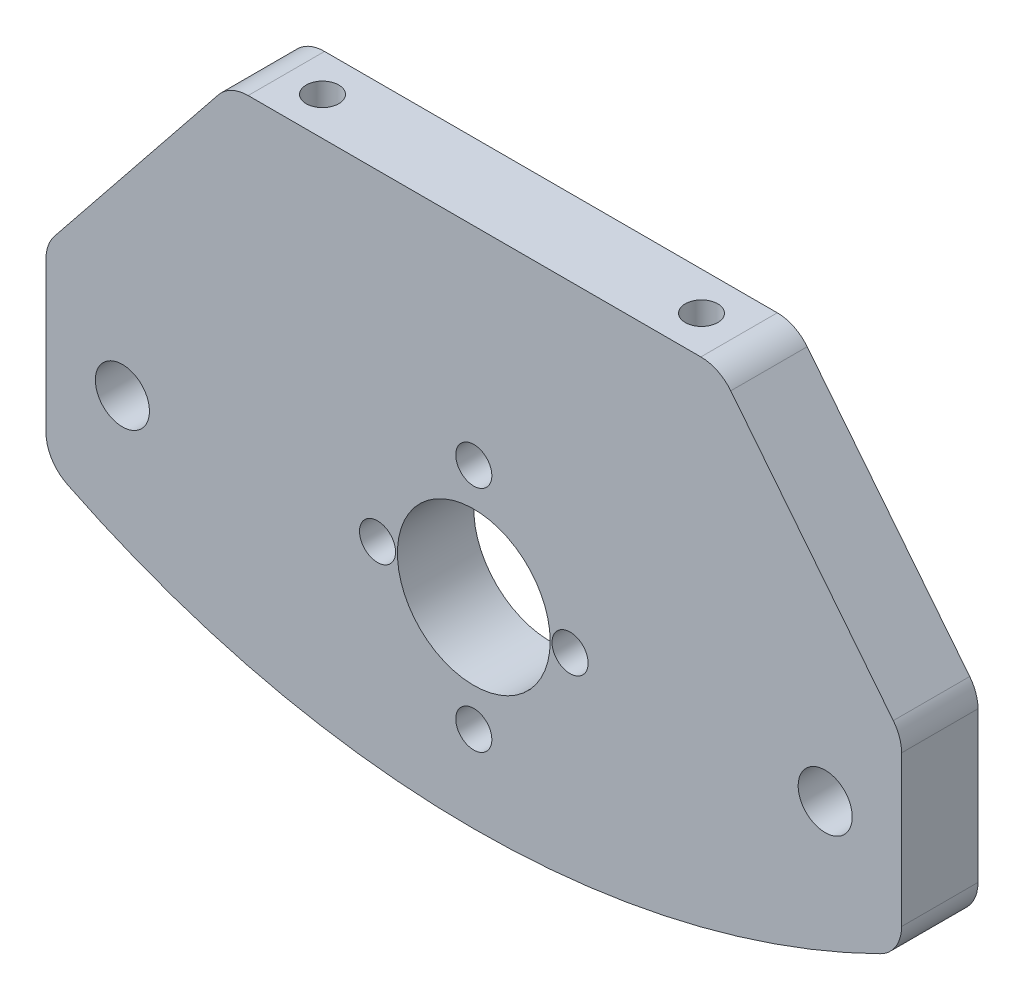
ISO-10303-21;
HEADER;
FILE_DESCRIPTION(('STEP AP214'),'2;1');
FILE_NAME('part.step','',(''),(''),'','','');
FILE_SCHEMA(('AUTOMOTIVE_DESIGN { 1 0 10303 214 1 1 1 1 }'));
ENDSEC;
DATA;
#1=APPLICATION_CONTEXT('core data for automotive mechanical design processes');
#2=APPLICATION_PROTOCOL_DEFINITION('international standard','automotive_design',2000,#1);
#3=PRODUCT_CONTEXT('',#1,'mechanical');
#4=PRODUCT('Part','Part','',(#3));
#5=PRODUCT_RELATED_PRODUCT_CATEGORY('part','',(#4));
#6=PRODUCT_DEFINITION_FORMATION('','',#4);
#7=PRODUCT_DEFINITION_CONTEXT('part definition',#1,'design');
#8=PRODUCT_DEFINITION('design','',#6,#7);
#9=PRODUCT_DEFINITION_SHAPE('','',#8);
#10=(LENGTH_UNIT() NAMED_UNIT(*) SI_UNIT(.MILLI.,.METRE.));
#11=(NAMED_UNIT(*) PLANE_ANGLE_UNIT() SI_UNIT($,.RADIAN.));
#12=(NAMED_UNIT(*) SI_UNIT($,.STERADIAN.) SOLID_ANGLE_UNIT());
#13=UNCERTAINTY_MEASURE_WITH_UNIT(LENGTH_MEASURE(1.E-05),#10,'distance_accuracy_value','');
#14=(GEOMETRIC_REPRESENTATION_CONTEXT(3) GLOBAL_UNCERTAINTY_ASSIGNED_CONTEXT((#13)) GLOBAL_UNIT_ASSIGNED_CONTEXT((#10,
#11,#12)) REPRESENTATION_CONTEXT('',''));
#15=CARTESIAN_POINT('',(0.,0.,0.));
#16=DIRECTION('',(0.,0.,1.));
#17=DIRECTION('',(1.,0.,0.));
#18=AXIS2_PLACEMENT_3D('',#15,#16,#17);
#19=CARTESIAN_POINT('',(0.,0.,6.35));
#20=DIRECTION('',(0.,0.,1.));
#21=DIRECTION('',(1.,0.,0.));
#22=AXIS2_PLACEMENT_3D('',#19,#20,#21);
#23=PLANE('',#22);
#24=CARTESIAN_POINT('',(29.2049999999999,-0.0909781516825678,6.35));
#25=DIRECTION('',(0.,0.,-1.));
#26=DIRECTION('',(-1.,0.,0.));
#27=AXIS2_PLACEMENT_3D('',#24,#25,#26);
#28=CIRCLE('',#27,2.2479);
#29=CARTESIAN_POINT('',(26.9570999999999,-0.0909781516825678,6.35));
#30=VERTEX_POINT('',#29);
#31=EDGE_CURVE('E165',#30,#30,#28,.T.);
#32=ORIENTED_EDGE('',*,*,#31,.T.);
#33=EDGE_LOOP('',(#32));
#34=FACE_BOUND('',#33,.T.);
#35=CARTESIAN_POINT('',(-29.2049999999999,-0.0909781516825678,6.35));
#36=DIRECTION('',(0.,0.,-1.));
#37=DIRECTION('',(-1.,0.,0.));
#38=AXIS2_PLACEMENT_3D('',#35,#36,#37);
#39=CIRCLE('',#38,2.2479);
#40=CARTESIAN_POINT('',(-31.4528999999999,-0.0909781516825678,6.35));
#41=VERTEX_POINT('',#40);
#42=EDGE_CURVE('E171',#41,#41,#39,.T.);
#43=ORIENTED_EDGE('',*,*,#42,.T.);
#44=EDGE_LOOP('',(#43));
#45=FACE_BOUND('',#44,.T.);
#46=CARTESIAN_POINT('',(8.,0.,6.35));
#47=DIRECTION('',(0.,0.,1.));
#48=DIRECTION('',(1.,0.,0.));
#49=AXIS2_PLACEMENT_3D('',#46,#47,#48);
#50=CIRCLE('',#49,1.5);
#51=CARTESIAN_POINT('',(9.5,0.,6.35));
#52=VERTEX_POINT('',#51);
#53=EDGE_CURVE('E181',#52,#52,#50,.T.);
#54=ORIENTED_EDGE('',*,*,#53,.F.);
#55=EDGE_LOOP('',(#54));
#56=FACE_BOUND('',#55,.T.);
#57=CARTESIAN_POINT('',(-8.,0.,6.35));
#58=DIRECTION('',(0.,0.,1.));
#59=DIRECTION('',(1.,0.,0.));
#60=AXIS2_PLACEMENT_3D('',#57,#58,#59);
#61=CIRCLE('',#60,1.5);
#62=CARTESIAN_POINT('',(-6.5,0.,6.35));
#63=VERTEX_POINT('',#62);
#64=EDGE_CURVE('E193',#63,#63,#61,.T.);
#65=ORIENTED_EDGE('',*,*,#64,.F.);
#66=EDGE_LOOP('',(#65));
#67=FACE_BOUND('',#66,.T.);
#68=CARTESIAN_POINT('',(0.,0.,6.35));
#69=DIRECTION('',(0.,0.,1.));
#70=DIRECTION('',(1.,0.,0.));
#71=AXIS2_PLACEMENT_3D('',#68,#69,#70);
#72=CIRCLE('',#71,6.35);
#73=CARTESIAN_POINT('',(6.35,0.,6.35));
#74=VERTEX_POINT('',#73);
#75=EDGE_CURVE('E199',#74,#74,#72,.T.);
#76=ORIENTED_EDGE('',*,*,#75,.F.);
#77=EDGE_LOOP('',(#76));
#78=FACE_BOUND('',#77,.T.);
#79=CARTESIAN_POINT('',(0.,9.5,6.35));
#80=DIRECTION('',(0.,0.,1.));
#81=DIRECTION('',(1.,0.,0.));
#82=AXIS2_PLACEMENT_3D('',#79,#80,#81);
#83=CIRCLE('',#82,1.5);
#84=CARTESIAN_POINT('',(1.5,9.5,6.35));
#85=VERTEX_POINT('',#84);
#86=EDGE_CURVE('E187',#85,#85,#83,.T.);
#87=ORIENTED_EDGE('',*,*,#86,.F.);
#88=EDGE_LOOP('',(#87));
#89=FACE_BOUND('',#88,.T.);
#90=CARTESIAN_POINT('',(0.,-9.5,6.35));
#91=DIRECTION('',(0.,0.,1.));
#92=DIRECTION('',(1.,0.,0.));
#93=AXIS2_PLACEMENT_3D('',#90,#91,#92);
#94=CIRCLE('',#93,1.5);
#95=CARTESIAN_POINT('',(1.5,-9.5,6.35));
#96=VERTEX_POINT('',#95);
#97=EDGE_CURVE('E175',#96,#96,#94,.T.);
#98=ORIENTED_EDGE('',*,*,#97,.F.);
#99=EDGE_LOOP('',(#98));
#100=FACE_BOUND('',#99,.T.);
#101=DIRECTION('',(-1.,0.,0.));
#102=VECTOR('',#101,1.);
#103=CARTESIAN_POINT('',(-35.5549999999999,26.7340218483174,6.35));
#104=LINE('',#103,#102);
#105=CARTESIAN_POINT('',(18.8729479416649,26.7340218483174,6.35));
#106=VERTEX_POINT('',#105);
#107=CARTESIAN_POINT('',(-18.7539057192393,26.7340218483174,6.35));
#108=VERTEX_POINT('',#107);
#109=EDGE_CURVE('E211',#106,#108,#104,.T.);
#110=ORIENTED_EDGE('',*,*,#109,.T.);
#111=CARTESIAN_POINT('',(-18.7539057192393,23.5590218483174,6.35));
#112=DIRECTION('',(0.,0.,1.));
#113=DIRECTION('',(1.,0.,0.));
#114=AXIS2_PLACEMENT_3D('',#111,#112,#113);
#115=CIRCLE('',#114,3.175);
#116=CARTESIAN_POINT('',(-21.2307871675687,25.5453962568623,6.35));
#117=VERTEX_POINT('',#116);
#118=EDGE_CURVE('E252',#108,#117,#115,.T.);
#119=ORIENTED_EDGE('',*,*,#118,.T.);
#120=DIRECTION('',(-0.625629734974753,-0.780120141206097,0.));
#121=VECTOR('',#120,1.);
#122=CARTESIAN_POINT('',(-25.3886387933931,20.3608220332872,6.35));
#123=LINE('',#122,#121);
#124=CARTESIAN_POINT('',(-34.8568814483293,8.55453089330413,6.35));
#125=VERTEX_POINT('',#124);
#126=EDGE_CURVE('E291',#117,#125,#123,.T.);
#127=ORIENTED_EDGE('',*,*,#126,.T.);
#128=CARTESIAN_POINT('',(-32.3799999999999,6.5681564847593,6.35));
#129=DIRECTION('',(0.,0.,1.));
#130=DIRECTION('',(1.,0.,0.));
#131=AXIS2_PLACEMENT_3D('',#128,#129,#130);
#132=CIRCLE('',#131,3.175);
#133=CARTESIAN_POINT('',(-35.5549999999999,6.5681564847593,6.35));
#134=VERTEX_POINT('',#133);
#135=EDGE_CURVE('E245',#125,#134,#132,.T.);
#136=ORIENTED_EDGE('',*,*,#135,.T.);
#137=DIRECTION('',(0.,-1.,0.));
#138=VECTOR('',#137,1.);
#139=CARTESIAN_POINT('',(-35.5549999999999,26.7340218483174,6.35));
#140=LINE('',#139,#138);
#141=CARTESIAN_POINT('',(-35.5549999999999,-5.92321969833574,6.35));
#142=VERTEX_POINT('',#141);
#143=EDGE_CURVE('E205',#134,#142,#140,.T.);
#144=ORIENTED_EDGE('',*,*,#143,.T.);
#145=CARTESIAN_POINT('',(-32.3799999999999,-5.92321969833576,6.35));
#146=DIRECTION('',(0.,0.,1.));
#147=DIRECTION('',(1.,0.,0.));
#148=AXIS2_PLACEMENT_3D('',#145,#146,#147);
#149=CIRCLE('',#148,3.175);
#150=CARTESIAN_POINT('',(-33.7878260869564,-8.76903253632857,6.35));
#151=VERTEX_POINT('',#150);
#152=EDGE_CURVE('E243',#142,#151,#149,.T.);
#153=ORIENTED_EDGE('',*,*,#152,.T.);
#154=CARTESIAN_POINT('',(3.64291929955129E-13,59.5304755754991,6.35));
#155=DIRECTION('',(0.,0.,-1.));
#156=DIRECTION('',(-1.,0.,0.));
#157=AXIS2_PLACEMENT_3D('',#154,#155,#156);
#158=CIRCLE('',#157,76.2000000000003);
#159=CARTESIAN_POINT('',(33.7878260869564,-8.76903253632894,6.35));
#160=VERTEX_POINT('',#159);
#161=EDGE_CURVE('E286',#160,#151,#158,.T.);
#162=ORIENTED_EDGE('',*,*,#161,.F.);
#163=CARTESIAN_POINT('',(32.3799999999999,-5.92321969833613,6.35));
#164=DIRECTION('',(0.,0.,1.));
#165=DIRECTION('',(1.,0.,0.));
#166=AXIS2_PLACEMENT_3D('',#163,#164,#165);
#167=CIRCLE('',#166,3.175);
#168=CARTESIAN_POINT('',(35.5549999999999,-5.92321969833611,6.35));
#169=VERTEX_POINT('',#168);
#170=EDGE_CURVE('E247',#160,#169,#167,.T.);
#171=ORIENTED_EDGE('',*,*,#170,.T.);
#172=DIRECTION('',(0.,1.,0.));
#173=VECTOR('',#172,1.);
#174=CARTESIAN_POINT('',(35.5549999999999,26.7340218483174,6.35));
#175=LINE('',#174,#173);
#176=CARTESIAN_POINT('',(35.5549999999999,6.57541134755412,6.35));
#177=VERTEX_POINT('',#176);
#178=EDGE_CURVE('E208',#169,#177,#175,.T.);
#179=ORIENTED_EDGE('',*,*,#178,.T.);
#180=CARTESIAN_POINT('',(32.3799999999999,6.57541134755411,6.35));
#181=DIRECTION('',(0.,0.,1.));
#182=DIRECTION('',(1.,0.,0.));
#183=AXIS2_PLACEMENT_3D('',#180,#181,#182);
#184=CIRCLE('',#183,3.175);
#185=CARTESIAN_POINT('',(34.8649463871635,8.55168725261457,6.35));
#186=VERTEX_POINT('',#185);
#187=EDGE_CURVE('E66',#177,#186,#184,.T.);
#188=ORIENTED_EDGE('',*,*,#187,.T.);
#189=DIRECTION('',(-0.622449103956051,0.782660279421608,0.));
#190=VECTOR('',#189,1.);
#191=CARTESIAN_POINT('',(25.5228637970199,20.2983134810263,6.35));
#192=LINE('',#191,#190);
#193=CARTESIAN_POINT('',(21.3578943288285,25.5352977533779,6.35));
#194=VERTEX_POINT('',#193);
#195=EDGE_CURVE('E156',#186,#194,#192,.T.);
#196=ORIENTED_EDGE('',*,*,#195,.T.);
#197=CARTESIAN_POINT('',(18.8729479416649,23.5590218483174,6.35));
#198=DIRECTION('',(0.,0.,1.));
#199=DIRECTION('',(1.,0.,0.));
#200=AXIS2_PLACEMENT_3D('',#197,#198,#199);
#201=CIRCLE('',#200,3.175);
#202=EDGE_CURVE('E250',#194,#106,#201,.T.);
#203=ORIENTED_EDGE('',*,*,#202,.T.);
#204=EDGE_LOOP('',(#110,#119,#127,#136,#144,#153,#162,#171,#179,#188,#196,#203));
#205=FACE_BOUND('',#204,.T.);
#206=ADVANCED_FACE('F44',(#34,#45,#56,#67,#78,#89,#100,#205),#23,.T.);
#207=CARTESIAN_POINT('',(0.,0.,0.));
#208=DIRECTION('',(0.,0.,1.));
#209=DIRECTION('',(1.,0.,0.));
#210=AXIS2_PLACEMENT_3D('',#207,#208,#209);
#211=PLANE('',#210);
#212=CARTESIAN_POINT('',(0.,-9.5,0.));
#213=DIRECTION('',(0.,0.,1.));
#214=DIRECTION('',(1.,0.,0.));
#215=AXIS2_PLACEMENT_3D('',#212,#213,#214);
#216=CIRCLE('',#215,1.5);
#217=CARTESIAN_POINT('',(1.5,-9.5,0.));
#218=VERTEX_POINT('',#217);
#219=EDGE_CURVE('E174',#218,#218,#216,.T.);
#220=ORIENTED_EDGE('',*,*,#219,.T.);
#221=EDGE_LOOP('',(#220));
#222=FACE_BOUND('',#221,.T.);
#223=CARTESIAN_POINT('',(8.,0.,0.));
#224=DIRECTION('',(0.,0.,1.));
#225=DIRECTION('',(1.,0.,0.));
#226=AXIS2_PLACEMENT_3D('',#223,#224,#225);
#227=CIRCLE('',#226,1.5);
#228=CARTESIAN_POINT('',(9.5,0.,0.));
#229=VERTEX_POINT('',#228);
#230=EDGE_CURVE('E178',#229,#229,#227,.T.);
#231=ORIENTED_EDGE('',*,*,#230,.T.);
#232=EDGE_LOOP('',(#231));
#233=FACE_BOUND('',#232,.T.);
#234=CARTESIAN_POINT('',(0.,9.5,0.));
#235=DIRECTION('',(0.,0.,1.));
#236=DIRECTION('',(1.,0.,0.));
#237=AXIS2_PLACEMENT_3D('',#234,#235,#236);
#238=CIRCLE('',#237,1.5);
#239=CARTESIAN_POINT('',(1.5,9.5,0.));
#240=VERTEX_POINT('',#239);
#241=EDGE_CURVE('E184',#240,#240,#238,.T.);
#242=ORIENTED_EDGE('',*,*,#241,.T.);
#243=EDGE_LOOP('',(#242));
#244=FACE_BOUND('',#243,.T.);
#245=CARTESIAN_POINT('',(-8.,0.,0.));
#246=DIRECTION('',(0.,0.,1.));
#247=DIRECTION('',(1.,0.,0.));
#248=AXIS2_PLACEMENT_3D('',#245,#246,#247);
#249=CIRCLE('',#248,1.5);
#250=CARTESIAN_POINT('',(-6.5,0.,0.));
#251=VERTEX_POINT('',#250);
#252=EDGE_CURVE('E190',#251,#251,#249,.T.);
#253=ORIENTED_EDGE('',*,*,#252,.T.);
#254=EDGE_LOOP('',(#253));
#255=FACE_BOUND('',#254,.T.);
#256=CARTESIAN_POINT('',(0.,0.,0.));
#257=DIRECTION('',(0.,0.,1.));
#258=DIRECTION('',(1.,0.,0.));
#259=AXIS2_PLACEMENT_3D('',#256,#257,#258);
#260=CIRCLE('',#259,6.35);
#261=CARTESIAN_POINT('',(6.35,0.,0.));
#262=VERTEX_POINT('',#261);
#263=EDGE_CURVE('E196',#262,#262,#260,.T.);
#264=ORIENTED_EDGE('',*,*,#263,.T.);
#265=EDGE_LOOP('',(#264));
#266=FACE_BOUND('',#265,.T.);
#267=CARTESIAN_POINT('',(-29.2049999999999,-0.0909781516825678,0.));
#268=DIRECTION('',(0.,0.,-1.));
#269=DIRECTION('',(-1.,0.,0.));
#270=AXIS2_PLACEMENT_3D('',#267,#268,#269);
#271=CIRCLE('',#270,2.2479);
#272=CARTESIAN_POINT('',(-31.4528999999999,-0.0909781516825678,0.));
#273=VERTEX_POINT('',#272);
#274=EDGE_CURVE('E168',#273,#273,#271,.T.);
#275=ORIENTED_EDGE('',*,*,#274,.F.);
#276=EDGE_LOOP('',(#275));
#277=FACE_BOUND('',#276,.T.);
#278=CARTESIAN_POINT('',(29.2049999999999,-0.0909781516825678,0.));
#279=DIRECTION('',(0.,0.,-1.));
#280=DIRECTION('',(-1.,0.,0.));
#281=AXIS2_PLACEMENT_3D('',#278,#279,#280);
#282=CIRCLE('',#281,2.2479);
#283=CARTESIAN_POINT('',(26.9570999999999,-0.0909781516825678,0.));
#284=VERTEX_POINT('',#283);
#285=EDGE_CURVE('E162',#284,#284,#282,.T.);
#286=ORIENTED_EDGE('',*,*,#285,.F.);
#287=EDGE_LOOP('',(#286));
#288=FACE_BOUND('',#287,.T.);
#289=DIRECTION('',(-0.625629734974753,-0.780120141206097,0.));
#290=VECTOR('',#289,1.);
#291=CARTESIAN_POINT('',(-25.3886387933931,20.3608220332872,0.));
#292=LINE('',#291,#290);
#293=CARTESIAN_POINT('',(-21.2307871675687,25.5453962568623,0.));
#294=VERTEX_POINT('',#293);
#295=CARTESIAN_POINT('',(-34.8568814483293,8.55453089330413,0.));
#296=VERTEX_POINT('',#295);
#297=EDGE_CURVE('E293',#294,#296,#292,.T.);
#298=ORIENTED_EDGE('',*,*,#297,.F.);
#299=CARTESIAN_POINT('',(-18.7539057192393,23.5590218483174,0.));
#300=DIRECTION('',(0.,0.,1.));
#301=DIRECTION('',(1.,0.,0.));
#302=AXIS2_PLACEMENT_3D('',#299,#300,#301);
#303=CIRCLE('',#302,3.175);
#304=CARTESIAN_POINT('',(-18.7539057192393,26.7340218483174,0.));
#305=VERTEX_POINT('',#304);
#306=EDGE_CURVE('E236',#294,#305,#303,.F.);
#307=ORIENTED_EDGE('',*,*,#306,.T.);
#308=DIRECTION('',(-1.,0.,0.));
#309=VECTOR('',#308,1.);
#310=CARTESIAN_POINT('',(-35.5549999999999,26.7340218483174,0.));
#311=LINE('',#310,#309);
#312=CARTESIAN_POINT('',(18.8729479416649,26.7340218483174,0.));
#313=VERTEX_POINT('',#312);
#314=EDGE_CURVE('E209',#313,#305,#311,.T.);
#315=ORIENTED_EDGE('',*,*,#314,.F.);
#316=CARTESIAN_POINT('',(18.8729479416649,23.5590218483174,0.));
#317=DIRECTION('',(0.,0.,1.));
#318=DIRECTION('',(1.,0.,0.));
#319=AXIS2_PLACEMENT_3D('',#316,#317,#318);
#320=CIRCLE('',#319,3.175);
#321=CARTESIAN_POINT('',(21.3578943288285,25.5352977533779,0.));
#322=VERTEX_POINT('',#321);
#323=EDGE_CURVE('E234',#313,#322,#320,.F.);
#324=ORIENTED_EDGE('',*,*,#323,.T.);
#325=DIRECTION('',(-0.622449103956051,0.782660279421608,0.));
#326=VECTOR('',#325,1.);
#327=CARTESIAN_POINT('',(25.5228637970199,20.2983134810263,0.));
#328=LINE('',#327,#326);
#329=CARTESIAN_POINT('',(34.8649463871635,8.55168725261457,0.));
#330=VERTEX_POINT('',#329);
#331=EDGE_CURVE('E298',#330,#322,#328,.T.);
#332=ORIENTED_EDGE('',*,*,#331,.F.);
#333=CARTESIAN_POINT('',(32.3799999999999,6.57541134755411,0.));
#334=DIRECTION('',(0.,0.,1.));
#335=DIRECTION('',(1.,0.,0.));
#336=AXIS2_PLACEMENT_3D('',#333,#334,#335);
#337=CIRCLE('',#336,3.175);
#338=CARTESIAN_POINT('',(35.5549999999999,6.57541134755412,0.));
#339=VERTEX_POINT('',#338);
#340=EDGE_CURVE('E232',#330,#339,#337,.F.);
#341=ORIENTED_EDGE('',*,*,#340,.T.);
#342=DIRECTION('',(0.,1.,0.));
#343=VECTOR('',#342,1.);
#344=CARTESIAN_POINT('',(35.5549999999999,26.7340218483174,0.));
#345=LINE('',#344,#343);
#346=CARTESIAN_POINT('',(35.5549999999999,-5.92321969833611,0.));
#347=VERTEX_POINT('',#346);
#348=EDGE_CURVE('E217',#347,#339,#345,.T.);
#349=ORIENTED_EDGE('',*,*,#348,.F.);
#350=CARTESIAN_POINT('',(32.3799999999999,-5.92321969833613,0.));
#351=DIRECTION('',(0.,0.,1.));
#352=DIRECTION('',(1.,0.,0.));
#353=AXIS2_PLACEMENT_3D('',#350,#351,#352);
#354=CIRCLE('',#353,3.175);
#355=CARTESIAN_POINT('',(33.7878260869564,-8.76903253632894,0.));
#356=VERTEX_POINT('',#355);
#357=EDGE_CURVE('E230',#347,#356,#354,.F.);
#358=ORIENTED_EDGE('',*,*,#357,.T.);
#359=CARTESIAN_POINT('',(3.64291929955129E-13,59.5304755754991,0.));
#360=DIRECTION('',(0.,0.,-1.));
#361=DIRECTION('',(-1.,0.,0.));
#362=AXIS2_PLACEMENT_3D('',#359,#360,#361);
#363=CIRCLE('',#362,76.2000000000003);
#364=CARTESIAN_POINT('',(-33.7878260869564,-8.76903253632857,0.));
#365=VERTEX_POINT('',#364);
#366=EDGE_CURVE('E284',#356,#365,#363,.T.);
#367=ORIENTED_EDGE('',*,*,#366,.T.);
#368=CARTESIAN_POINT('',(-32.3799999999999,-5.92321969833576,0.));
#369=DIRECTION('',(0.,0.,1.));
#370=DIRECTION('',(1.,0.,0.));
#371=AXIS2_PLACEMENT_3D('',#368,#369,#370);
#372=CIRCLE('',#371,3.175);
#373=CARTESIAN_POINT('',(-35.5549999999999,-5.92321969833574,0.));
#374=VERTEX_POINT('',#373);
#375=EDGE_CURVE('E226',#365,#374,#372,.F.);
#376=ORIENTED_EDGE('',*,*,#375,.T.);
#377=DIRECTION('',(0.,-1.,0.));
#378=VECTOR('',#377,1.);
#379=CARTESIAN_POINT('',(-35.5549999999999,26.7340218483174,0.));
#380=LINE('',#379,#378);
#381=CARTESIAN_POINT('',(-35.5549999999999,6.5681564847593,0.));
#382=VERTEX_POINT('',#381);
#383=EDGE_CURVE('E202',#382,#374,#380,.T.);
#384=ORIENTED_EDGE('',*,*,#383,.F.);
#385=CARTESIAN_POINT('',(-32.3799999999999,6.5681564847593,0.));
#386=DIRECTION('',(0.,0.,1.));
#387=DIRECTION('',(1.,0.,0.));
#388=AXIS2_PLACEMENT_3D('',#385,#386,#387);
#389=CIRCLE('',#388,3.175);
#390=EDGE_CURVE('E228',#382,#296,#389,.F.);
#391=ORIENTED_EDGE('',*,*,#390,.T.);
#392=EDGE_LOOP('',(#298,#307,#315,#324,#332,#341,#349,#358,#367,#376,#384,#391));
#393=FACE_BOUND('',#392,.T.);
#394=ADVANCED_FACE('F289',(#222,#233,#244,#255,#266,#277,#288,#393),#211,.F.);
#395=CARTESIAN_POINT('',(-35.5549999999999,26.7340218483174,6.35));
#396=DIRECTION('',(1.,0.,0.));
#397=DIRECTION('',(0.,1.,0.));
#398=AXIS2_PLACEMENT_3D('',#395,#396,#397);
#399=PLANE('',#398);
#400=ORIENTED_EDGE('',*,*,#143,.F.);
#401=DIRECTION('',(0.,0.,-1.));
#402=VECTOR('',#401,1.);
#403=CARTESIAN_POINT('',(-35.5549999999999,6.5681564847593,6.35));
#404=LINE('',#403,#402);
#405=EDGE_CURVE('E12',#134,#382,#404,.T.);
#406=ORIENTED_EDGE('',*,*,#405,.T.);
#407=ORIENTED_EDGE('',*,*,#383,.T.);
#408=DIRECTION('',(0.,0.,1.));
#409=VECTOR('',#408,1.);
#410=CARTESIAN_POINT('',(-35.5549999999999,-5.92321969833576,6.35));
#411=LINE('',#410,#409);
#412=EDGE_CURVE('E52',#374,#142,#411,.T.);
#413=ORIENTED_EDGE('',*,*,#412,.T.);
#414=EDGE_LOOP('',(#400,#406,#407,#413));
#415=FACE_BOUND('',#414,.T.);
#416=ADVANCED_FACE('F270',(#415),#399,.F.);
#417=CARTESIAN_POINT('',(35.5549999999999,26.7340218483174,6.35));
#418=DIRECTION('',(-1.,0.,0.));
#419=DIRECTION('',(0.,0.,1.));
#420=AXIS2_PLACEMENT_3D('',#417,#418,#419);
#421=PLANE('',#420);
#422=ORIENTED_EDGE('',*,*,#348,.T.);
#423=DIRECTION('',(0.,0.,-1.));
#424=VECTOR('',#423,1.);
#425=CARTESIAN_POINT('',(35.5549999999999,6.57541134755411,6.35));
#426=LINE('',#425,#424);
#427=EDGE_CURVE('E261',#339,#177,#426,.F.);
#428=ORIENTED_EDGE('',*,*,#427,.T.);
#429=ORIENTED_EDGE('',*,*,#178,.F.);
#430=DIRECTION('',(0.,0.,1.));
#431=VECTOR('',#430,1.);
#432=CARTESIAN_POINT('',(35.5549999999999,-5.92321969833613,0.));
#433=LINE('',#432,#431);
#434=EDGE_CURVE('E258',#169,#347,#433,.F.);
#435=ORIENTED_EDGE('',*,*,#434,.T.);
#436=EDGE_LOOP('',(#422,#428,#429,#435));
#437=FACE_BOUND('',#436,.T.);
#438=ADVANCED_FACE('F346',(#437),#421,.F.);
#439=CARTESIAN_POINT('',(-35.5549999999999,26.7340218483174,6.35));
#440=DIRECTION('',(0.,-1.,0.));
#441=DIRECTION('',(0.,0.,-1.));
#442=AXIS2_PLACEMENT_3D('',#439,#440,#441);
#443=PLANE('',#442);
#444=CARTESIAN_POINT('',(15.75,26.7340218483174,3.175));
#445=DIRECTION('',(0.,1.,0.));
#446=DIRECTION('',(0.,0.,1.));
#447=AXIS2_PLACEMENT_3D('',#444,#445,#446);
#448=CIRCLE('',#447,1.35254999999999);
#449=CARTESIAN_POINT('',(15.75,26.7340218483174,4.52754999999998));
#450=VERTEX_POINT('',#449);
#451=EDGE_CURVE('E150',#450,#450,#448,.T.);
#452=ORIENTED_EDGE('',*,*,#451,.F.);
#453=EDGE_LOOP('',(#452));
#454=FACE_BOUND('',#453,.T.);
#455=CARTESIAN_POINT('',(-15.75,26.7340218483174,3.175));
#456=DIRECTION('',(0.,1.,0.));
#457=DIRECTION('',(0.,0.,1.));
#458=AXIS2_PLACEMENT_3D('',#455,#456,#457);
#459=CIRCLE('',#458,1.35254999999999);
#460=CARTESIAN_POINT('',(-15.75,26.7340218483174,4.52754999999999));
#461=VERTEX_POINT('',#460);
#462=EDGE_CURVE('E149',#461,#461,#459,.T.);
#463=ORIENTED_EDGE('',*,*,#462,.F.);
#464=EDGE_LOOP('',(#463));
#465=FACE_BOUND('',#464,.T.);
#466=ORIENTED_EDGE('',*,*,#314,.T.);
#467=DIRECTION('',(0.,0.,-1.));
#468=VECTOR('',#467,1.);
#469=CARTESIAN_POINT('',(-18.7539057192393,26.7340218483174,6.35));
#470=LINE('',#469,#468);
#471=EDGE_CURVE('E241',#305,#108,#470,.F.);
#472=ORIENTED_EDGE('',*,*,#471,.T.);
#473=ORIENTED_EDGE('',*,*,#109,.F.);
#474=DIRECTION('',(0.,0.,-1.));
#475=VECTOR('',#474,1.);
#476=CARTESIAN_POINT('',(18.8729479416649,26.7340218483174,6.35));
#477=LINE('',#476,#475);
#478=EDGE_CURVE('E238',#106,#313,#477,.T.);
#479=ORIENTED_EDGE('',*,*,#478,.T.);
#480=EDGE_LOOP('',(#466,#472,#473,#479));
#481=FACE_BOUND('',#480,.T.);
#482=ADVANCED_FACE('F310',(#454,#465,#481),#443,.F.);
#483=CARTESIAN_POINT('',(0.,0.,6.35));
#484=DIRECTION('',(0.,0.,-1.));
#485=DIRECTION('',(-1.,0.,0.));
#486=AXIS2_PLACEMENT_3D('',#483,#484,#485);
#487=CYLINDRICAL_SURFACE('',#486,6.35);
#488=ORIENTED_EDGE('',*,*,#75,.T.);
#489=EDGE_LOOP('',(#488));
#490=FACE_BOUND('',#489,.T.);
#491=ORIENTED_EDGE('',*,*,#263,.F.);
#492=EDGE_LOOP('',(#491));
#493=FACE_BOUND('',#492,.T.);
#494=ADVANCED_FACE('F341',(#490,#493),#487,.F.);
#495=CARTESIAN_POINT('',(-8.,0.,6.35));
#496=DIRECTION('',(0.,0.,-1.));
#497=DIRECTION('',(-1.,0.,0.));
#498=AXIS2_PLACEMENT_3D('',#495,#496,#497);
#499=CYLINDRICAL_SURFACE('',#498,1.5);
#500=ORIENTED_EDGE('',*,*,#64,.T.);
#501=EDGE_LOOP('',(#500));
#502=FACE_BOUND('',#501,.T.);
#503=ORIENTED_EDGE('',*,*,#252,.F.);
#504=EDGE_LOOP('',(#503));
#505=FACE_BOUND('',#504,.T.);
#506=ADVANCED_FACE('F511',(#502,#505),#499,.F.);
#507=CARTESIAN_POINT('',(0.,9.5,6.35));
#508=DIRECTION('',(0.,0.,-1.));
#509=DIRECTION('',(-1.,0.,0.));
#510=AXIS2_PLACEMENT_3D('',#507,#508,#509);
#511=CYLINDRICAL_SURFACE('',#510,1.5);
#512=ORIENTED_EDGE('',*,*,#86,.T.);
#513=EDGE_LOOP('',(#512));
#514=FACE_BOUND('',#513,.T.);
#515=ORIENTED_EDGE('',*,*,#241,.F.);
#516=EDGE_LOOP('',(#515));
#517=FACE_BOUND('',#516,.T.);
#518=ADVANCED_FACE('F502',(#514,#517),#511,.F.);
#519=CARTESIAN_POINT('',(8.,0.,6.35));
#520=DIRECTION('',(0.,0.,-1.));
#521=DIRECTION('',(-1.,0.,0.));
#522=AXIS2_PLACEMENT_3D('',#519,#520,#521);
#523=CYLINDRICAL_SURFACE('',#522,1.5);
#524=ORIENTED_EDGE('',*,*,#53,.T.);
#525=EDGE_LOOP('',(#524));
#526=FACE_BOUND('',#525,.T.);
#527=ORIENTED_EDGE('',*,*,#230,.F.);
#528=EDGE_LOOP('',(#527));
#529=FACE_BOUND('',#528,.T.);
#530=ADVANCED_FACE('F493',(#526,#529),#523,.F.);
#531=CARTESIAN_POINT('',(0.,-9.5,6.35));
#532=DIRECTION('',(0.,0.,-1.));
#533=DIRECTION('',(-1.,0.,0.));
#534=AXIS2_PLACEMENT_3D('',#531,#532,#533);
#535=CYLINDRICAL_SURFACE('',#534,1.5);
#536=ORIENTED_EDGE('',*,*,#97,.T.);
#537=EDGE_LOOP('',(#536));
#538=FACE_BOUND('',#537,.T.);
#539=ORIENTED_EDGE('',*,*,#219,.F.);
#540=EDGE_LOOP('',(#539));
#541=FACE_BOUND('',#540,.T.);
#542=ADVANCED_FACE('F484',(#538,#541),#535,.F.);
#543=CARTESIAN_POINT('',(-29.2049999999999,-0.0909781516825678,0.));
#544=DIRECTION('',(0.,0.,-1.));
#545=DIRECTION('',(-1.,0.,0.));
#546=AXIS2_PLACEMENT_3D('',#543,#544,#545);
#547=CYLINDRICAL_SURFACE('',#546,2.2479);
#548=ORIENTED_EDGE('',*,*,#42,.F.);
#549=EDGE_LOOP('',(#548));
#550=FACE_BOUND('',#549,.T.);
#551=ORIENTED_EDGE('',*,*,#274,.T.);
#552=EDGE_LOOP('',(#551));
#553=FACE_BOUND('',#552,.T.);
#554=ADVANCED_FACE('F475',(#550,#553),#547,.F.);
#555=CARTESIAN_POINT('',(29.2049999999999,-0.0909781516825678,0.));
#556=DIRECTION('',(0.,0.,-1.));
#557=DIRECTION('',(-1.,0.,0.));
#558=AXIS2_PLACEMENT_3D('',#555,#556,#557);
#559=CYLINDRICAL_SURFACE('',#558,2.2479);
#560=ORIENTED_EDGE('',*,*,#31,.F.);
#561=EDGE_LOOP('',(#560));
#562=FACE_BOUND('',#561,.T.);
#563=ORIENTED_EDGE('',*,*,#285,.T.);
#564=EDGE_LOOP('',(#563));
#565=FACE_BOUND('',#564,.T.);
#566=ADVANCED_FACE('F466',(#562,#565),#559,.F.);
#567=CARTESIAN_POINT('',(-15.75,1.33402184831741,3.175));
#568=DIRECTION('',(0.,1.,0.));
#569=DIRECTION('',(0.,0.,1.));
#570=AXIS2_PLACEMENT_3D('',#567,#568,#569);
#571=CONICAL_SURFACE('',#570,1.35255,1.02974425867665);
#572=CARTESIAN_POINT('',(-15.75,0.521327818051684,3.175));
#573=VERTEX_POINT('',#572);
#574=VERTEX_LOOP('',#573);
#575=FACE_BOUND('',#574,.T.);
#576=CARTESIAN_POINT('',(-15.75,1.33402184831741,3.175));
#577=DIRECTION('',(0.,1.,0.));
#578=DIRECTION('',(0.,0.,1.));
#579=AXIS2_PLACEMENT_3D('',#576,#577,#578);
#580=CIRCLE('',#579,1.35255);
#581=CARTESIAN_POINT('',(-15.75,1.33402184831741,4.52754999999999));
#582=VERTEX_POINT('',#581);
#583=EDGE_CURVE('E153',#582,#582,#580,.T.);
#584=ORIENTED_EDGE('',*,*,#583,.T.);
#585=EDGE_LOOP('',(#584));
#586=FACE_BOUND('',#585,.T.);
#587=ADVANCED_FACE('F456',(#575,#586),#571,.F.);
#588=CARTESIAN_POINT('',(-15.75,26.7340218483174,3.175));
#589=DIRECTION('',(0.,1.,0.));
#590=DIRECTION('',(0.,0.,1.));
#591=AXIS2_PLACEMENT_3D('',#588,#589,#590);
#592=CYLINDRICAL_SURFACE('',#591,1.35254999999999);
#593=ORIENTED_EDGE('',*,*,#583,.F.);
#594=EDGE_LOOP('',(#593));
#595=FACE_BOUND('',#594,.T.);
#596=ORIENTED_EDGE('',*,*,#462,.T.);
#597=EDGE_LOOP('',(#596));
#598=FACE_BOUND('',#597,.T.);
#599=ADVANCED_FACE('F143',(#595,#598),#592,.F.);
#600=CARTESIAN_POINT('',(15.75,1.33402184831741,3.175));
#601=DIRECTION('',(0.,1.,0.));
#602=DIRECTION('',(0.,0.,1.));
#603=AXIS2_PLACEMENT_3D('',#600,#601,#602);
#604=CONICAL_SURFACE('',#603,1.35254999999999,1.02974425867665);
#605=CARTESIAN_POINT('',(15.75,0.521327818051684,3.175));
#606=VERTEX_POINT('',#605);
#607=VERTEX_LOOP('',#606);
#608=FACE_BOUND('',#607,.T.);
#609=CARTESIAN_POINT('',(15.75,1.33402184831741,3.175));
#610=DIRECTION('',(0.,1.,0.));
#611=DIRECTION('',(0.,0.,1.));
#612=AXIS2_PLACEMENT_3D('',#609,#610,#611);
#613=CIRCLE('',#612,1.35254999999999);
#614=CARTESIAN_POINT('',(15.75,1.33402184831741,4.52754999999999));
#615=VERTEX_POINT('',#614);
#616=EDGE_CURVE('E147',#615,#615,#613,.T.);
#617=ORIENTED_EDGE('',*,*,#616,.T.);
#618=EDGE_LOOP('',(#617));
#619=FACE_BOUND('',#618,.T.);
#620=ADVANCED_FACE('F139',(#608,#619),#604,.F.);
#621=CARTESIAN_POINT('',(15.75,26.7340218483174,3.175));
#622=DIRECTION('',(0.,1.,0.));
#623=DIRECTION('',(0.,0.,1.));
#624=AXIS2_PLACEMENT_3D('',#621,#622,#623);
#625=CYLINDRICAL_SURFACE('',#624,1.35254999999999);
#626=ORIENTED_EDGE('',*,*,#616,.F.);
#627=EDGE_LOOP('',(#626));
#628=FACE_BOUND('',#627,.T.);
#629=ORIENTED_EDGE('',*,*,#451,.T.);
#630=EDGE_LOOP('',(#629));
#631=FACE_BOUND('',#630,.T.);
#632=ADVANCED_FACE('F142',(#628,#631),#625,.F.);
#633=CARTESIAN_POINT('',(25.5228637970199,20.2983134810263,6.35));
#634=DIRECTION('',(-0.782660279421608,-0.622449103956051,0.));
#635=DIRECTION('',(0.622449103956051,-0.782660279421608,0.));
#636=AXIS2_PLACEMENT_3D('',#633,#634,#635);
#637=PLANE('',#636);
#638=ORIENTED_EDGE('',*,*,#331,.T.);
#639=DIRECTION('',(0.,0.,-1.));
#640=VECTOR('',#639,1.);
#641=CARTESIAN_POINT('',(21.3578943288285,25.5352977533779,6.35));
#642=LINE('',#641,#640);
#643=EDGE_CURVE('E59',#322,#194,#642,.F.);
#644=ORIENTED_EDGE('',*,*,#643,.T.);
#645=ORIENTED_EDGE('',*,*,#195,.F.);
#646=DIRECTION('',(0.,0.,-1.));
#647=VECTOR('',#646,1.);
#648=CARTESIAN_POINT('',(34.8649463871635,8.55168725261457,6.35));
#649=LINE('',#648,#647);
#650=EDGE_CURVE('E254',#186,#330,#649,.T.);
#651=ORIENTED_EDGE('',*,*,#650,.T.);
#652=EDGE_LOOP('',(#638,#644,#645,#651));
#653=FACE_BOUND('',#652,.T.);
#654=ADVANCED_FACE('F301',(#653),#637,.F.);
#655=CARTESIAN_POINT('',(-25.3886387933931,20.3608220332872,6.35));
#656=DIRECTION('',(0.780120141206097,-0.625629734974753,0.));
#657=DIRECTION('',(0.625629734974753,0.780120141206097,0.));
#658=AXIS2_PLACEMENT_3D('',#655,#656,#657);
#659=PLANE('',#658);
#660=ORIENTED_EDGE('',*,*,#126,.F.);
#661=DIRECTION('',(0.,0.,-1.));
#662=VECTOR('',#661,1.);
#663=CARTESIAN_POINT('',(-21.2307871675687,25.5453962568623,6.35));
#664=LINE('',#663,#662);
#665=EDGE_CURVE('E223',#117,#294,#664,.T.);
#666=ORIENTED_EDGE('',*,*,#665,.T.);
#667=ORIENTED_EDGE('',*,*,#297,.T.);
#668=DIRECTION('',(0.,0.,-1.));
#669=VECTOR('',#668,1.);
#670=CARTESIAN_POINT('',(-34.8568814483293,8.55453089330413,6.35));
#671=LINE('',#670,#669);
#672=EDGE_CURVE('E214',#296,#125,#671,.F.);
#673=ORIENTED_EDGE('',*,*,#672,.T.);
#674=EDGE_LOOP('',(#660,#666,#667,#673));
#675=FACE_BOUND('',#674,.T.);
#676=ADVANCED_FACE('F318',(#675),#659,.F.);
#677=CARTESIAN_POINT('',(3.64291929955129E-13,59.5304755754991,6.35));
#678=DIRECTION('',(0.,0.,-1.));
#679=DIRECTION('',(-1.,0.,0.));
#680=AXIS2_PLACEMENT_3D('',#677,#678,#679);
#681=CYLINDRICAL_SURFACE('',#680,76.2000000000003);
#682=ORIENTED_EDGE('',*,*,#366,.F.);
#683=DIRECTION('',(0.,0.,-1.));
#684=VECTOR('',#683,1.);
#685=CARTESIAN_POINT('',(33.7878260869564,-8.76903253632894,6.35));
#686=LINE('',#685,#684);
#687=EDGE_CURVE('E266',#356,#160,#686,.F.);
#688=ORIENTED_EDGE('',*,*,#687,.T.);
#689=ORIENTED_EDGE('',*,*,#161,.T.);
#690=DIRECTION('',(0.,0.,-1.));
#691=VECTOR('',#690,1.);
#692=CARTESIAN_POINT('',(-33.7878260869564,-8.76903253632857,6.35));
#693=LINE('',#692,#691);
#694=EDGE_CURVE('E263',#151,#365,#693,.T.);
#695=ORIENTED_EDGE('',*,*,#694,.T.);
#696=EDGE_LOOP('',(#682,#688,#689,#695));
#697=FACE_BOUND('',#696,.T.);
#698=ADVANCED_FACE('F283',(#697),#681,.T.);
#699=CARTESIAN_POINT('',(-18.7539057192393,23.5590218483174,6.35));
#700=DIRECTION('',(0.,0.,-1.));
#701=DIRECTION('',(-1.,0.,0.));
#702=AXIS2_PLACEMENT_3D('',#699,#700,#701);
#703=CYLINDRICAL_SURFACE('',#702,3.175);
#704=ORIENTED_EDGE('',*,*,#118,.F.);
#705=ORIENTED_EDGE('',*,*,#471,.F.);
#706=ORIENTED_EDGE('',*,*,#306,.F.);
#707=ORIENTED_EDGE('',*,*,#665,.F.);
#708=EDGE_LOOP('',(#704,#705,#706,#707));
#709=FACE_BOUND('',#708,.T.);
#710=ADVANCED_FACE('F314',(#709),#703,.T.);
#711=CARTESIAN_POINT('',(18.8729479416649,23.5590218483174,6.35));
#712=DIRECTION('',(0.,0.,-1.));
#713=DIRECTION('',(-1.,0.,0.));
#714=AXIS2_PLACEMENT_3D('',#711,#712,#713);
#715=CYLINDRICAL_SURFACE('',#714,3.175);
#716=ORIENTED_EDGE('',*,*,#202,.F.);
#717=ORIENTED_EDGE('',*,*,#643,.F.);
#718=ORIENTED_EDGE('',*,*,#323,.F.);
#719=ORIENTED_EDGE('',*,*,#478,.F.);
#720=EDGE_LOOP('',(#716,#717,#718,#719));
#721=FACE_BOUND('',#720,.T.);
#722=ADVANCED_FACE('F305',(#721),#715,.T.);
#723=CARTESIAN_POINT('',(32.3799999999999,6.57541134755411,6.35));
#724=DIRECTION('',(0.,0.,-1.));
#725=DIRECTION('',(-1.,0.,0.));
#726=AXIS2_PLACEMENT_3D('',#723,#724,#725);
#727=CYLINDRICAL_SURFACE('',#726,3.175);
#728=ORIENTED_EDGE('',*,*,#187,.F.);
#729=ORIENTED_EDGE('',*,*,#427,.F.);
#730=ORIENTED_EDGE('',*,*,#340,.F.);
#731=ORIENTED_EDGE('',*,*,#650,.F.);
#732=EDGE_LOOP('',(#728,#729,#730,#731));
#733=FACE_BOUND('',#732,.T.);
#734=ADVANCED_FACE('F328',(#733),#727,.T.);
#735=CARTESIAN_POINT('',(32.3799999999999,-5.92321969833613,6.35));
#736=DIRECTION('',(0.,0.,-1.));
#737=DIRECTION('',(-1.,0.,0.));
#738=AXIS2_PLACEMENT_3D('',#735,#736,#737);
#739=CYLINDRICAL_SURFACE('',#738,3.175);
#740=ORIENTED_EDGE('',*,*,#170,.F.);
#741=ORIENTED_EDGE('',*,*,#687,.F.);
#742=ORIENTED_EDGE('',*,*,#357,.F.);
#743=ORIENTED_EDGE('',*,*,#434,.F.);
#744=EDGE_LOOP('',(#740,#741,#742,#743));
#745=FACE_BOUND('',#744,.T.);
#746=ADVANCED_FACE('F323',(#745),#739,.T.);
#747=CARTESIAN_POINT('',(-32.3799999999999,6.5681564847593,6.35));
#748=DIRECTION('',(0.,0.,-1.));
#749=DIRECTION('',(-1.,0.,0.));
#750=AXIS2_PLACEMENT_3D('',#747,#748,#749);
#751=CYLINDRICAL_SURFACE('',#750,3.175);
#752=ORIENTED_EDGE('',*,*,#135,.F.);
#753=ORIENTED_EDGE('',*,*,#672,.F.);
#754=ORIENTED_EDGE('',*,*,#390,.F.);
#755=ORIENTED_EDGE('',*,*,#405,.F.);
#756=EDGE_LOOP('',(#752,#753,#754,#755));
#757=FACE_BOUND('',#756,.T.);
#758=ADVANCED_FACE('F321',(#757),#751,.T.);
#759=CARTESIAN_POINT('',(-32.3799999999999,-5.92321969833576,6.35));
#760=DIRECTION('',(0.,0.,-1.));
#761=DIRECTION('',(-1.,0.,0.));
#762=AXIS2_PLACEMENT_3D('',#759,#760,#761);
#763=CYLINDRICAL_SURFACE('',#762,3.175);
#764=ORIENTED_EDGE('',*,*,#152,.F.);
#765=ORIENTED_EDGE('',*,*,#412,.F.);
#766=ORIENTED_EDGE('',*,*,#375,.F.);
#767=ORIENTED_EDGE('',*,*,#694,.F.);
#768=EDGE_LOOP('',(#764,#765,#766,#767));
#769=FACE_BOUND('',#768,.T.);
#770=ADVANCED_FACE('F46',(#769),#763,.T.);
#771=CLOSED_SHELL('',(#206,#394,#416,#438,#482,#494,#506,#518,#530,#542,#554,#566,#587,#599,
#620,#632,#654,#676,#698,#710,#722,#734,#746,#758,#770));
#772=MANIFOLD_SOLID_BREP('B2',#771);
#773=ADVANCED_BREP_SHAPE_REPRESENTATION('',(#18,#772),#14);
#774=SHAPE_DEFINITION_REPRESENTATION(#9,#773);
ENDSEC;
END-ISO-10303-21;
